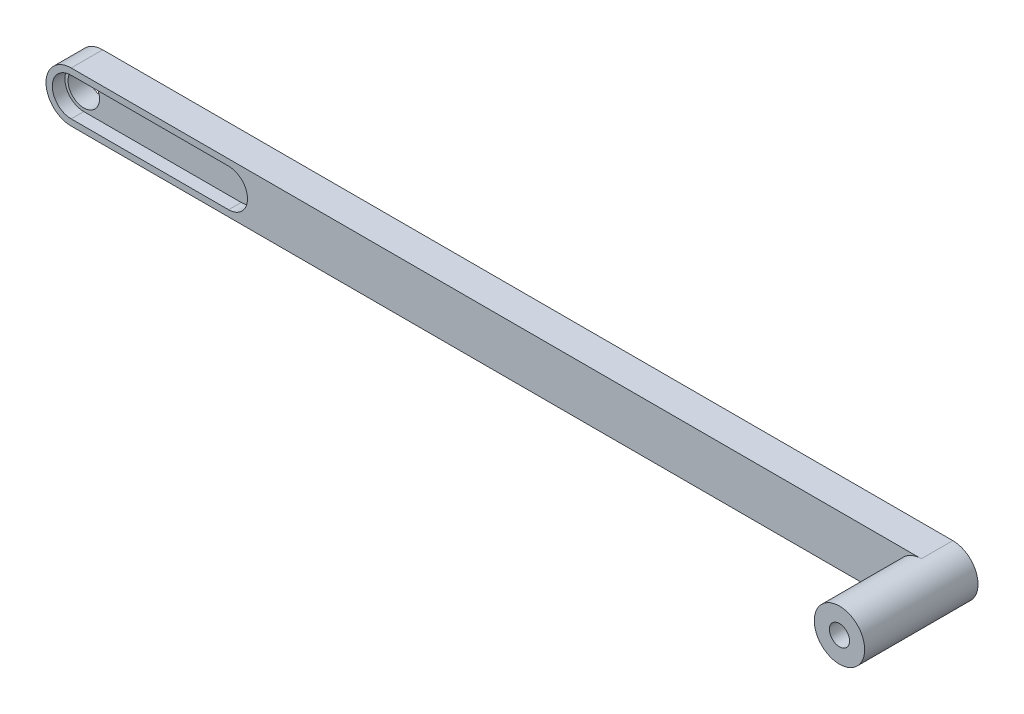
ISO-10303-21;
HEADER;
FILE_DESCRIPTION(('STEP AP214'),'2;1');
FILE_NAME('part.step','',(''),(''),'','','');
FILE_SCHEMA(('AUTOMOTIVE_DESIGN { 1 0 10303 214 1 1 1 1 }'));
ENDSEC;
DATA;
#1=APPLICATION_CONTEXT('core data for automotive mechanical design processes');
#2=APPLICATION_PROTOCOL_DEFINITION('international standard','automotive_design',2000,#1);
#3=PRODUCT_CONTEXT('',#1,'mechanical');
#4=PRODUCT('Part','Part','',(#3));
#5=PRODUCT_RELATED_PRODUCT_CATEGORY('part','',(#4));
#6=PRODUCT_DEFINITION_FORMATION('','',#4);
#7=PRODUCT_DEFINITION_CONTEXT('part definition',#1,'design');
#8=PRODUCT_DEFINITION('design','',#6,#7);
#9=PRODUCT_DEFINITION_SHAPE('','',#8);
#10=(LENGTH_UNIT() NAMED_UNIT(*) SI_UNIT(.MILLI.,.METRE.));
#11=(NAMED_UNIT(*) PLANE_ANGLE_UNIT() SI_UNIT($,.RADIAN.));
#12=(NAMED_UNIT(*) SI_UNIT($,.STERADIAN.) SOLID_ANGLE_UNIT());
#13=UNCERTAINTY_MEASURE_WITH_UNIT(LENGTH_MEASURE(1.E-05),#10,'distance_accuracy_value','');
#14=(GEOMETRIC_REPRESENTATION_CONTEXT(3) GLOBAL_UNCERTAINTY_ASSIGNED_CONTEXT((#13)) GLOBAL_UNIT_ASSIGNED_CONTEXT((#10,
#11,#12)) REPRESENTATION_CONTEXT('',''));
#15=CARTESIAN_POINT('',(0.,0.,0.));
#16=DIRECTION('',(0.,0.,1.));
#17=DIRECTION('',(1.,0.,0.));
#18=AXIS2_PLACEMENT_3D('',#15,#16,#17);
#19=CARTESIAN_POINT('',(0.,0.,5.));
#20=DIRECTION('',(0.,0.,-1.));
#21=DIRECTION('',(-1.,0.,0.));
#22=AXIS2_PLACEMENT_3D('',#19,#20,#21);
#23=CYLINDRICAL_SURFACE('',#22,2.5);
#24=CARTESIAN_POINT('',(0.,0.,0.));
#25=DIRECTION('',(0.,0.,1.));
#26=DIRECTION('',(1.,0.,0.));
#27=AXIS2_PLACEMENT_3D('',#24,#25,#26);
#28=CIRCLE('',#27,2.5);
#29=CARTESIAN_POINT('',(2.5,0.,0.));
#30=VERTEX_POINT('',#29);
#31=EDGE_CURVE('E189',#30,#30,#28,.T.);
#32=ORIENTED_EDGE('',*,*,#31,.F.);
#33=EDGE_LOOP('',(#32));
#34=FACE_BOUND('',#33,.T.);
#35=CARTESIAN_POINT('',(0.,0.,3.));
#36=DIRECTION('',(0.,0.,1.));
#37=DIRECTION('',(1.,0.,0.));
#38=AXIS2_PLACEMENT_3D('',#35,#36,#37);
#39=CIRCLE('',#38,2.5);
#40=CARTESIAN_POINT('',(2.5,0.,3.));
#41=VERTEX_POINT('',#40);
#42=EDGE_CURVE('E51',#41,#41,#39,.T.);
#43=ORIENTED_EDGE('',*,*,#42,.T.);
#44=EDGE_LOOP('',(#43));
#45=FACE_BOUND('',#44,.T.);
#46=ADVANCED_FACE('F47',(#34,#45),#23,.F.);
#47=CARTESIAN_POINT('',(0.,0.,5.));
#48=DIRECTION('',(0.,0.,1.));
#49=DIRECTION('',(1.,0.,0.));
#50=AXIS2_PLACEMENT_3D('',#47,#48,#49);
#51=PLANE('',#50);
#52=CARTESIAN_POINT('',(0.,0.,5.));
#53=DIRECTION('',(0.,0.,1.));
#54=DIRECTION('',(1.,0.,0.));
#55=AXIS2_PLACEMENT_3D('',#52,#53,#54);
#56=CIRCLE('',#55,3.);
#57=CARTESIAN_POINT('',(0.,3.,5.));
#58=VERTEX_POINT('',#57);
#59=CARTESIAN_POINT('',(0.,-3.,5.));
#60=VERTEX_POINT('',#59);
#61=EDGE_CURVE('E64',#58,#60,#56,.T.);
#62=ORIENTED_EDGE('',*,*,#61,.F.);
#63=DIRECTION('',(-1.,0.,0.));
#64=VECTOR('',#63,1.);
#65=CARTESIAN_POINT('',(0.,3.,5.));
#66=LINE('',#65,#64);
#67=CARTESIAN_POINT('',(25.,3.,5.));
#68=VERTEX_POINT('',#67);
#69=EDGE_CURVE('E146',#68,#58,#66,.T.);
#70=ORIENTED_EDGE('',*,*,#69,.F.);
#71=CARTESIAN_POINT('',(25.,0.,5.));
#72=DIRECTION('',(0.,0.,1.));
#73=DIRECTION('',(1.,0.,0.));
#74=AXIS2_PLACEMENT_3D('',#71,#72,#73);
#75=CIRCLE('',#74,3.);
#76=CARTESIAN_POINT('',(25.,-3.,5.));
#77=VERTEX_POINT('',#76);
#78=EDGE_CURVE('E150',#77,#68,#75,.T.);
#79=ORIENTED_EDGE('',*,*,#78,.F.);
#80=DIRECTION('',(1.,0.,0.));
#81=VECTOR('',#80,1.);
#82=CARTESIAN_POINT('',(0.,-3.,5.));
#83=LINE('',#82,#81);
#84=EDGE_CURVE('E159',#60,#77,#83,.T.);
#85=ORIENTED_EDGE('',*,*,#84,.F.);
#86=EDGE_LOOP('',(#62,#70,#79,#85));
#87=FACE_BOUND('',#86,.T.);
#88=CARTESIAN_POINT('',(135.,0.,5.));
#89=DIRECTION('',(0.,0.,1.));
#90=DIRECTION('',(1.,0.,0.));
#91=AXIS2_PLACEMENT_3D('',#88,#89,#90);
#92=CIRCLE('',#91,4.);
#93=CARTESIAN_POINT('',(135.,4.,5.));
#94=VERTEX_POINT('',#93);
#95=CARTESIAN_POINT('',(135.,-4.,5.));
#96=VERTEX_POINT('',#95);
#97=EDGE_CURVE('E178',#94,#96,#92,.T.);
#98=ORIENTED_EDGE('',*,*,#97,.F.);
#99=DIRECTION('',(-1.,0.,0.));
#100=VECTOR('',#99,1.);
#101=CARTESIAN_POINT('',(0.,4.,5.));
#102=LINE('',#101,#100);
#103=CARTESIAN_POINT('',(0.,4.,5.));
#104=VERTEX_POINT('',#103);
#105=EDGE_CURVE('E73',#94,#104,#102,.T.);
#106=ORIENTED_EDGE('',*,*,#105,.T.);
#107=CARTESIAN_POINT('',(0.,0.,5.));
#108=DIRECTION('',(0.,0.,1.));
#109=DIRECTION('',(1.,0.,0.));
#110=AXIS2_PLACEMENT_3D('',#107,#108,#109);
#111=CIRCLE('',#110,4.);
#112=CARTESIAN_POINT('',(0.,-4.,5.));
#113=VERTEX_POINT('',#112);
#114=EDGE_CURVE('E194',#104,#113,#111,.T.);
#115=ORIENTED_EDGE('',*,*,#114,.T.);
#116=DIRECTION('',(1.,0.,0.));
#117=VECTOR('',#116,1.);
#118=CARTESIAN_POINT('',(0.,-4.,5.));
#119=LINE('',#118,#117);
#120=EDGE_CURVE('E99',#113,#96,#119,.T.);
#121=ORIENTED_EDGE('',*,*,#120,.T.);
#122=EDGE_LOOP('',(#98,#106,#115,#121));
#123=FACE_BOUND('',#122,.T.);
#124=ADVANCED_FACE('F233',(#87,#123),#51,.T.);
#125=CARTESIAN_POINT('',(0.,0.,0.));
#126=DIRECTION('',(0.,0.,1.));
#127=DIRECTION('',(1.,0.,0.));
#128=AXIS2_PLACEMENT_3D('',#125,#126,#127);
#129=PLANE('',#128);
#130=CARTESIAN_POINT('',(0.,0.,0.));
#131=DIRECTION('',(0.,0.,1.));
#132=DIRECTION('',(1.,0.,0.));
#133=AXIS2_PLACEMENT_3D('',#130,#131,#132);
#134=CIRCLE('',#133,4.);
#135=CARTESIAN_POINT('',(0.,4.,0.));
#136=VERTEX_POINT('',#135);
#137=CARTESIAN_POINT('',(0.,-4.,0.));
#138=VERTEX_POINT('',#137);
#139=EDGE_CURVE('E193',#136,#138,#134,.T.);
#140=ORIENTED_EDGE('',*,*,#139,.F.);
#141=DIRECTION('',(-1.,0.,0.));
#142=VECTOR('',#141,1.);
#143=CARTESIAN_POINT('',(0.,4.,0.));
#144=LINE('',#143,#142);
#145=CARTESIAN_POINT('',(135.,4.,0.));
#146=VERTEX_POINT('',#145);
#147=EDGE_CURVE('E94',#146,#136,#144,.T.);
#148=ORIENTED_EDGE('',*,*,#147,.F.);
#149=CARTESIAN_POINT('',(135.,0.,0.));
#150=DIRECTION('',(0.,0.,1.));
#151=DIRECTION('',(1.,0.,0.));
#152=AXIS2_PLACEMENT_3D('',#149,#150,#151);
#153=CIRCLE('',#152,4.);
#154=CARTESIAN_POINT('',(135.,-4.,0.));
#155=VERTEX_POINT('',#154);
#156=EDGE_CURVE('E208',#155,#146,#153,.T.);
#157=ORIENTED_EDGE('',*,*,#156,.F.);
#158=DIRECTION('',(1.,0.,0.));
#159=VECTOR('',#158,1.);
#160=CARTESIAN_POINT('',(0.,-4.,0.));
#161=LINE('',#160,#159);
#162=EDGE_CURVE('E205',#138,#155,#161,.T.);
#163=ORIENTED_EDGE('',*,*,#162,.F.);
#164=EDGE_LOOP('',(#140,#148,#157,#163));
#165=FACE_BOUND('',#164,.T.);
#166=ORIENTED_EDGE('',*,*,#31,.T.);
#167=EDGE_LOOP('',(#166));
#168=FACE_BOUND('',#167,.T.);
#169=CARTESIAN_POINT('',(135.,0.,0.));
#170=DIRECTION('',(0.,0.,1.));
#171=DIRECTION('',(1.,0.,0.));
#172=AXIS2_PLACEMENT_3D('',#169,#170,#171);
#173=CIRCLE('',#172,1.59999999999999);
#174=CARTESIAN_POINT('',(136.6,0.,0.));
#175=VERTEX_POINT('',#174);
#176=EDGE_CURVE('E182',#175,#175,#173,.T.);
#177=ORIENTED_EDGE('',*,*,#176,.T.);
#178=EDGE_LOOP('',(#177));
#179=FACE_BOUND('',#178,.T.);
#180=ADVANCED_FACE('F227',(#165,#168,#179),#129,.F.);
#181=CARTESIAN_POINT('',(0.,0.,5.));
#182=DIRECTION('',(0.,0.,-1.));
#183=DIRECTION('',(-1.,0.,0.));
#184=AXIS2_PLACEMENT_3D('',#181,#182,#183);
#185=CYLINDRICAL_SURFACE('',#184,4.);
#186=ORIENTED_EDGE('',*,*,#139,.T.);
#187=DIRECTION('',(0.,0.,-1.));
#188=VECTOR('',#187,1.);
#189=CARTESIAN_POINT('',(0.,-4.,5.));
#190=LINE('',#189,#188);
#191=EDGE_CURVE('E11',#113,#138,#190,.T.);
#192=ORIENTED_EDGE('',*,*,#191,.F.);
#193=ORIENTED_EDGE('',*,*,#114,.F.);
#194=DIRECTION('',(0.,0.,-1.));
#195=VECTOR('',#194,1.);
#196=CARTESIAN_POINT('',(0.,4.,5.));
#197=LINE('',#196,#195);
#198=EDGE_CURVE('E201',#104,#136,#197,.T.);
#199=ORIENTED_EDGE('',*,*,#198,.T.);
#200=EDGE_LOOP('',(#186,#192,#193,#199));
#201=FACE_BOUND('',#200,.T.);
#202=ADVANCED_FACE('F49',(#201),#185,.T.);
#203=CARTESIAN_POINT('',(0.,-4.,5.));
#204=DIRECTION('',(0.,1.,0.));
#205=DIRECTION('',(0.,0.,1.));
#206=AXIS2_PLACEMENT_3D('',#203,#204,#205);
#207=PLANE('',#206);
#208=ORIENTED_EDGE('',*,*,#162,.T.);
#209=DIRECTION('',(0.,0.,-1.));
#210=VECTOR('',#209,1.);
#211=CARTESIAN_POINT('',(135.,-4.,5.));
#212=LINE('',#211,#210);
#213=EDGE_CURVE('E57',#96,#155,#212,.T.);
#214=ORIENTED_EDGE('',*,*,#213,.F.);
#215=ORIENTED_EDGE('',*,*,#120,.F.);
#216=ORIENTED_EDGE('',*,*,#191,.T.);
#217=EDGE_LOOP('',(#208,#214,#215,#216));
#218=FACE_BOUND('',#217,.T.);
#219=ADVANCED_FACE('F250',(#218),#207,.F.);
#220=CARTESIAN_POINT('',(135.,0.,5.));
#221=DIRECTION('',(0.,0.,-1.));
#222=DIRECTION('',(-1.,0.,0.));
#223=AXIS2_PLACEMENT_3D('',#220,#221,#222);
#224=CYLINDRICAL_SURFACE('',#223,4.);
#225=ORIENTED_EDGE('',*,*,#156,.T.);
#226=DIRECTION('',(0.,0.,-1.));
#227=VECTOR('',#226,1.);
#228=CARTESIAN_POINT('',(135.,4.,5.));
#229=LINE('',#228,#227);
#230=EDGE_CURVE('E215',#94,#146,#229,.T.);
#231=ORIENTED_EDGE('',*,*,#230,.F.);
#232=ORIENTED_EDGE('',*,*,#97,.T.);
#233=ORIENTED_EDGE('',*,*,#213,.T.);
#234=EDGE_LOOP('',(#225,#231,#232,#233));
#235=FACE_BOUND('',#234,.T.);
#236=CARTESIAN_POINT('',(135.,0.,18.));
#237=DIRECTION('',(0.,0.,1.));
#238=DIRECTION('',(1.,0.,0.));
#239=AXIS2_PLACEMENT_3D('',#236,#237,#238);
#240=CIRCLE('',#239,4.);
#241=CARTESIAN_POINT('',(139.,0.,18.));
#242=VERTEX_POINT('',#241);
#243=EDGE_CURVE('E177',#242,#242,#240,.T.);
#244=ORIENTED_EDGE('',*,*,#243,.F.);
#245=EDGE_LOOP('',(#244));
#246=FACE_BOUND('',#245,.T.);
#247=ADVANCED_FACE('F222',(#235,#246),#224,.T.);
#248=CARTESIAN_POINT('',(0.,4.,5.));
#249=DIRECTION('',(0.,-1.,0.));
#250=DIRECTION('',(0.,0.,-1.));
#251=AXIS2_PLACEMENT_3D('',#248,#249,#250);
#252=PLANE('',#251);
#253=ORIENTED_EDGE('',*,*,#147,.T.);
#254=ORIENTED_EDGE('',*,*,#198,.F.);
#255=ORIENTED_EDGE('',*,*,#105,.F.);
#256=ORIENTED_EDGE('',*,*,#230,.T.);
#257=EDGE_LOOP('',(#253,#254,#255,#256));
#258=FACE_BOUND('',#257,.T.);
#259=ADVANCED_FACE('F232',(#258),#252,.F.);
#260=CARTESIAN_POINT('',(135.,0.,5.));
#261=DIRECTION('',(0.,0.,-1.));
#262=DIRECTION('',(-1.,0.,0.));
#263=AXIS2_PLACEMENT_3D('',#260,#261,#262);
#264=CYLINDRICAL_SURFACE('',#263,1.59999999999999);
#265=ORIENTED_EDGE('',*,*,#176,.F.);
#266=EDGE_LOOP('',(#265));
#267=FACE_BOUND('',#266,.T.);
#268=CARTESIAN_POINT('',(135.,0.,18.));
#269=DIRECTION('',(0.,0.,1.));
#270=DIRECTION('',(1.,0.,0.));
#271=AXIS2_PLACEMENT_3D('',#268,#269,#270);
#272=CIRCLE('',#271,1.59999999999999);
#273=CARTESIAN_POINT('',(136.6,0.,18.));
#274=VERTEX_POINT('',#273);
#275=EDGE_CURVE('E173',#274,#274,#272,.F.);
#276=ORIENTED_EDGE('',*,*,#275,.F.);
#277=EDGE_LOOP('',(#276));
#278=FACE_BOUND('',#277,.T.);
#279=ADVANCED_FACE('F248',(#267,#278),#264,.F.);
#280=CARTESIAN_POINT('',(0.,0.,18.));
#281=DIRECTION('',(0.,0.,1.));
#282=DIRECTION('',(1.,0.,0.));
#283=AXIS2_PLACEMENT_3D('',#280,#281,#282);
#284=PLANE('',#283);
#285=ORIENTED_EDGE('',*,*,#275,.T.);
#286=EDGE_LOOP('',(#285));
#287=FACE_BOUND('',#286,.T.);
#288=ORIENTED_EDGE('',*,*,#243,.T.);
#289=EDGE_LOOP('',(#288));
#290=FACE_BOUND('',#289,.T.);
#291=ADVANCED_FACE('F281',(#287,#290),#284,.T.);
#292=CARTESIAN_POINT('',(0.,0.,3.));
#293=DIRECTION('',(0.,0.,1.));
#294=DIRECTION('',(1.,0.,0.));
#295=AXIS2_PLACEMENT_3D('',#292,#293,#294);
#296=CYLINDRICAL_SURFACE('',#295,3.);
#297=ORIENTED_EDGE('',*,*,#61,.T.);
#298=DIRECTION('',(0.,0.,1.));
#299=VECTOR('',#298,1.);
#300=CARTESIAN_POINT('',(0.,-3.,3.));
#301=LINE('',#300,#299);
#302=CARTESIAN_POINT('',(0.,-3.,3.));
#303=VERTEX_POINT('',#302);
#304=EDGE_CURVE('E121',#303,#60,#301,.T.);
#305=ORIENTED_EDGE('',*,*,#304,.F.);
#306=CARTESIAN_POINT('',(0.,0.,3.));
#307=DIRECTION('',(0.,0.,1.));
#308=DIRECTION('',(1.,0.,0.));
#309=AXIS2_PLACEMENT_3D('',#306,#307,#308);
#310=CIRCLE('',#309,3.);
#311=CARTESIAN_POINT('',(0.,3.,3.));
#312=VERTEX_POINT('',#311);
#313=EDGE_CURVE('E125',#312,#303,#310,.T.);
#314=ORIENTED_EDGE('',*,*,#313,.F.);
#315=DIRECTION('',(0.,0.,1.));
#316=VECTOR('',#315,1.);
#317=CARTESIAN_POINT('',(0.,3.,3.));
#318=LINE('',#317,#316);
#319=EDGE_CURVE('E165',#312,#58,#318,.T.);
#320=ORIENTED_EDGE('',*,*,#319,.T.);
#321=EDGE_LOOP('',(#297,#305,#314,#320));
#322=FACE_BOUND('',#321,.T.);
#323=ADVANCED_FACE('F123',(#322),#296,.F.);
#324=CARTESIAN_POINT('',(0.,3.,3.));
#325=DIRECTION('',(0.,1.,0.));
#326=DIRECTION('',(0.,0.,1.));
#327=AXIS2_PLACEMENT_3D('',#324,#325,#326);
#328=PLANE('',#327);
#329=ORIENTED_EDGE('',*,*,#69,.T.);
#330=ORIENTED_EDGE('',*,*,#319,.F.);
#331=DIRECTION('',(-1.,0.,0.));
#332=VECTOR('',#331,1.);
#333=CARTESIAN_POINT('',(0.,3.,3.));
#334=LINE('',#333,#332);
#335=CARTESIAN_POINT('',(25.,3.,3.));
#336=VERTEX_POINT('',#335);
#337=EDGE_CURVE('E132',#336,#312,#334,.T.);
#338=ORIENTED_EDGE('',*,*,#337,.F.);
#339=DIRECTION('',(0.,0.,1.));
#340=VECTOR('',#339,1.);
#341=CARTESIAN_POINT('',(25.,3.,3.));
#342=LINE('',#341,#340);
#343=EDGE_CURVE('E168',#336,#68,#342,.T.);
#344=ORIENTED_EDGE('',*,*,#343,.T.);
#345=EDGE_LOOP('',(#329,#330,#338,#344));
#346=FACE_BOUND('',#345,.T.);
#347=ADVANCED_FACE('F366',(#346),#328,.F.);
#348=CARTESIAN_POINT('',(25.,0.,3.));
#349=DIRECTION('',(0.,0.,1.));
#350=DIRECTION('',(1.,0.,0.));
#351=AXIS2_PLACEMENT_3D('',#348,#349,#350);
#352=CYLINDRICAL_SURFACE('',#351,3.);
#353=ORIENTED_EDGE('',*,*,#78,.T.);
#354=ORIENTED_EDGE('',*,*,#343,.F.);
#355=CARTESIAN_POINT('',(25.,0.,3.));
#356=DIRECTION('',(0.,0.,1.));
#357=DIRECTION('',(1.,0.,0.));
#358=AXIS2_PLACEMENT_3D('',#355,#356,#357);
#359=CIRCLE('',#358,3.);
#360=CARTESIAN_POINT('',(25.,-3.,3.));
#361=VERTEX_POINT('',#360);
#362=EDGE_CURVE('E141',#361,#336,#359,.T.);
#363=ORIENTED_EDGE('',*,*,#362,.F.);
#364=DIRECTION('',(0.,0.,1.));
#365=VECTOR('',#364,1.);
#366=CARTESIAN_POINT('',(25.,-3.,3.));
#367=LINE('',#366,#365);
#368=EDGE_CURVE('E131',#361,#77,#367,.T.);
#369=ORIENTED_EDGE('',*,*,#368,.T.);
#370=EDGE_LOOP('',(#353,#354,#363,#369));
#371=FACE_BOUND('',#370,.T.);
#372=ADVANCED_FACE('F372',(#371),#352,.F.);
#373=CARTESIAN_POINT('',(0.,-3.,3.));
#374=DIRECTION('',(0.,-1.,0.));
#375=DIRECTION('',(0.,0.,-1.));
#376=AXIS2_PLACEMENT_3D('',#373,#374,#375);
#377=PLANE('',#376);
#378=ORIENTED_EDGE('',*,*,#84,.T.);
#379=ORIENTED_EDGE('',*,*,#368,.F.);
#380=DIRECTION('',(1.,0.,0.));
#381=VECTOR('',#380,1.);
#382=CARTESIAN_POINT('',(0.,-3.,3.));
#383=LINE('',#382,#381);
#384=EDGE_CURVE('E135',#303,#361,#383,.T.);
#385=ORIENTED_EDGE('',*,*,#384,.F.);
#386=ORIENTED_EDGE('',*,*,#304,.T.);
#387=EDGE_LOOP('',(#378,#379,#385,#386));
#388=FACE_BOUND('',#387,.T.);
#389=ADVANCED_FACE('F136',(#388),#377,.F.);
#390=CARTESIAN_POINT('',(0.,0.,3.));
#391=DIRECTION('',(0.,0.,1.));
#392=DIRECTION('',(1.,0.,0.));
#393=AXIS2_PLACEMENT_3D('',#390,#391,#392);
#394=PLANE('',#393);
#395=ORIENTED_EDGE('',*,*,#42,.F.);
#396=EDGE_LOOP('',(#395));
#397=FACE_BOUND('',#396,.T.);
#398=ORIENTED_EDGE('',*,*,#313,.T.);
#399=ORIENTED_EDGE('',*,*,#384,.T.);
#400=ORIENTED_EDGE('',*,*,#362,.T.);
#401=ORIENTED_EDGE('',*,*,#337,.T.);
#402=EDGE_LOOP('',(#398,#399,#400,#401));
#403=FACE_BOUND('',#402,.T.);
#404=ADVANCED_FACE('F143',(#397,#403),#394,.T.);
#405=CLOSED_SHELL('',(#46,#124,#180,#202,#219,#247,#259,#279,#291,#323,#347,#372,#389,#404));
#406=MANIFOLD_SOLID_BREP('B2',#405);
#407=ADVANCED_BREP_SHAPE_REPRESENTATION('',(#18,#406),#14);
#408=SHAPE_DEFINITION_REPRESENTATION(#9,#407);
ENDSEC;
END-ISO-10303-21;
